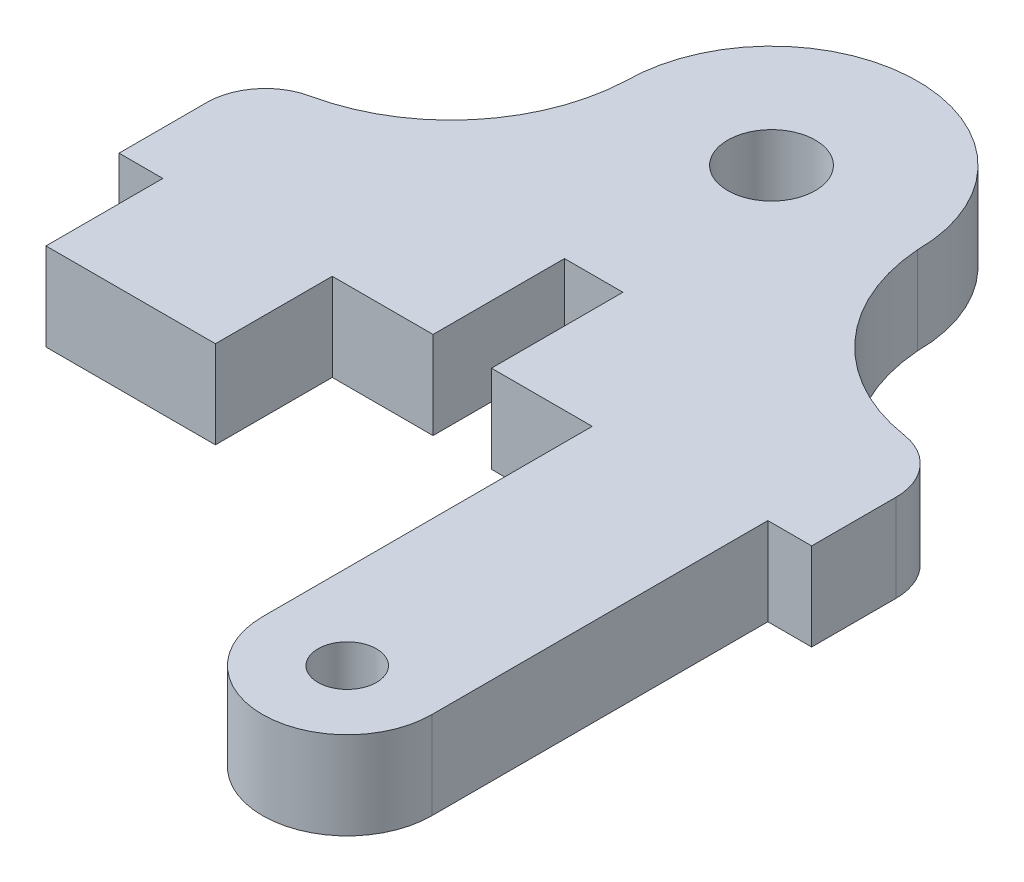
ISO-10303-21;
HEADER;
FILE_DESCRIPTION(('STEP AP214'),'2;1');
FILE_NAME('part.step','',(''),(''),'','','');
FILE_SCHEMA(('AUTOMOTIVE_DESIGN { 1 0 10303 214 1 1 1 1 }'));
ENDSEC;
DATA;
#1=APPLICATION_CONTEXT('core data for automotive mechanical design processes');
#2=APPLICATION_PROTOCOL_DEFINITION('international standard','automotive_design',2000,#1);
#3=PRODUCT_CONTEXT('',#1,'mechanical');
#4=PRODUCT('Part','Part','',(#3));
#5=PRODUCT_RELATED_PRODUCT_CATEGORY('part','',(#4));
#6=PRODUCT_DEFINITION_FORMATION('','',#4);
#7=PRODUCT_DEFINITION_CONTEXT('part definition',#1,'design');
#8=PRODUCT_DEFINITION('design','',#6,#7);
#9=PRODUCT_DEFINITION_SHAPE('','',#8);
#10=(LENGTH_UNIT() NAMED_UNIT(*) SI_UNIT(.MILLI.,.METRE.));
#11=(NAMED_UNIT(*) PLANE_ANGLE_UNIT() SI_UNIT($,.RADIAN.));
#12=(NAMED_UNIT(*) SI_UNIT($,.STERADIAN.) SOLID_ANGLE_UNIT());
#13=UNCERTAINTY_MEASURE_WITH_UNIT(LENGTH_MEASURE(1.E-05),#10,'distance_accuracy_value','');
#14=(GEOMETRIC_REPRESENTATION_CONTEXT(3) GLOBAL_UNCERTAINTY_ASSIGNED_CONTEXT((#13)) GLOBAL_UNIT_ASSIGNED_CONTEXT((#10,
#11,#12)) REPRESENTATION_CONTEXT('',''));
#15=CARTESIAN_POINT('',(0.,0.,0.));
#16=DIRECTION('',(0.,0.,1.));
#17=DIRECTION('',(1.,0.,0.));
#18=AXIS2_PLACEMENT_3D('',#15,#16,#17);
#19=CARTESIAN_POINT('',(7.56861177622339,3.,22.0944304402411));
#20=DIRECTION('',(0.,-1.,0.));
#21=DIRECTION('',(0.,0.,-1.));
#22=AXIS2_PLACEMENT_3D('',#19,#20,#21);
#23=CYLINDRICAL_SURFACE('',#22,2.9);
#24=CARTESIAN_POINT('',(7.56861177622339,0.,22.0944304402411));
#25=DIRECTION('',(0.,1.,0.));
#26=DIRECTION('',(0.,0.,1.));
#27=AXIS2_PLACEMENT_3D('',#24,#25,#26);
#28=CIRCLE('',#27,2.9);
#29=CARTESIAN_POINT('',(4.66861177622339,0.,22.0944304402411));
#30=VERTEX_POINT('',#29);
#31=CARTESIAN_POINT('',(10.4686117762234,0.,22.0944304402411));
#32=VERTEX_POINT('',#31);
#33=EDGE_CURVE('E198',#30,#32,#28,.T.);
#34=ORIENTED_EDGE('',*,*,#33,.T.);
#35=DIRECTION('',(0.,-1.,0.));
#36=VECTOR('',#35,1.);
#37=CARTESIAN_POINT('',(10.4686117762234,3.,22.0944304402411));
#38=LINE('',#37,#36);
#39=CARTESIAN_POINT('',(10.4686117762234,3.,22.0944304402411));
#40=VERTEX_POINT('',#39);
#41=EDGE_CURVE('E179',#40,#32,#38,.T.);
#42=ORIENTED_EDGE('',*,*,#41,.F.);
#43=CARTESIAN_POINT('',(7.56861177622339,3.,22.0944304402411));
#44=DIRECTION('',(0.,1.,0.));
#45=DIRECTION('',(0.,0.,1.));
#46=AXIS2_PLACEMENT_3D('',#43,#44,#45);
#47=CIRCLE('',#46,2.9);
#48=CARTESIAN_POINT('',(4.66861177622339,3.,22.0944304402411));
#49=VERTEX_POINT('',#48);
#50=EDGE_CURVE('E185',#49,#40,#47,.T.);
#51=ORIENTED_EDGE('',*,*,#50,.F.);
#52=DIRECTION('',(0.,-1.,0.));
#53=VECTOR('',#52,1.);
#54=CARTESIAN_POINT('',(4.66861177622339,3.,22.0944304402411));
#55=LINE('',#54,#53);
#56=EDGE_CURVE('E265',#49,#30,#55,.T.);
#57=ORIENTED_EDGE('',*,*,#56,.T.);
#58=EDGE_LOOP('',(#34,#42,#51,#57));
#59=FACE_BOUND('',#58,.T.);
#60=ADVANCED_FACE('F37',(#59),#23,.T.);
#61=CARTESIAN_POINT('',(10.4686117762234,3.,10.5944304402411));
#62=DIRECTION('',(-1.,0.,0.));
#63=DIRECTION('',(0.,0.,1.));
#64=AXIS2_PLACEMENT_3D('',#61,#62,#63);
#65=PLANE('',#64);
#66=DIRECTION('',(0.,0.,-1.));
#67=VECTOR('',#66,1.);
#68=CARTESIAN_POINT('',(10.4686117762234,0.,10.5944304402411));
#69=LINE('',#68,#67);
#70=CARTESIAN_POINT('',(10.4686117762234,0.,10.5944304402411));
#71=VERTEX_POINT('',#70);
#72=EDGE_CURVE('E307',#32,#71,#69,.T.);
#73=ORIENTED_EDGE('',*,*,#72,.T.);
#74=DIRECTION('',(0.,-1.,0.));
#75=VECTOR('',#74,1.);
#76=CARTESIAN_POINT('',(10.4686117762234,3.,10.5944304402411));
#77=LINE('',#76,#75);
#78=CARTESIAN_POINT('',(10.4686117762234,3.,10.5944304402411));
#79=VERTEX_POINT('',#78);
#80=EDGE_CURVE('E182',#79,#71,#77,.T.);
#81=ORIENTED_EDGE('',*,*,#80,.F.);
#82=DIRECTION('',(0.,0.,-1.));
#83=VECTOR('',#82,1.);
#84=CARTESIAN_POINT('',(10.4686117762234,3.,22.0944304402411));
#85=LINE('',#84,#83);
#86=EDGE_CURVE('E175',#40,#79,#85,.T.);
#87=ORIENTED_EDGE('',*,*,#86,.F.);
#88=ORIENTED_EDGE('',*,*,#41,.T.);
#89=EDGE_LOOP('',(#73,#81,#87,#88));
#90=FACE_BOUND('',#89,.T.);
#91=ADVANCED_FACE('F177',(#90),#65,.F.);
#92=CARTESIAN_POINT('',(11.9686117762234,3.,10.5944304402411));
#93=DIRECTION('',(0.,0.,-1.));
#94=DIRECTION('',(-1.,0.,0.));
#95=AXIS2_PLACEMENT_3D('',#92,#93,#94);
#96=PLANE('',#95);
#97=DIRECTION('',(1.,0.,0.));
#98=VECTOR('',#97,1.);
#99=CARTESIAN_POINT('',(11.9686117762234,0.,10.5944304402411));
#100=LINE('',#99,#98);
#101=CARTESIAN_POINT('',(11.9686117762234,0.,10.5944304402411));
#102=VERTEX_POINT('',#101);
#103=EDGE_CURVE('E237',#71,#102,#100,.T.);
#104=ORIENTED_EDGE('',*,*,#103,.T.);
#105=DIRECTION('',(0.,-1.,0.));
#106=VECTOR('',#105,1.);
#107=CARTESIAN_POINT('',(11.9686117762234,3.,10.5944304402411));
#108=LINE('',#107,#106);
#109=CARTESIAN_POINT('',(11.9686117762234,3.,10.5944304402411));
#110=VERTEX_POINT('',#109);
#111=EDGE_CURVE('E204',#110,#102,#108,.T.);
#112=ORIENTED_EDGE('',*,*,#111,.F.);
#113=DIRECTION('',(1.,0.,0.));
#114=VECTOR('',#113,1.);
#115=CARTESIAN_POINT('',(11.9686117762234,3.,10.5944304402411));
#116=LINE('',#115,#114);
#117=EDGE_CURVE('E184',#79,#110,#116,.T.);
#118=ORIENTED_EDGE('',*,*,#117,.F.);
#119=ORIENTED_EDGE('',*,*,#80,.T.);
#120=EDGE_LOOP('',(#104,#112,#118,#119));
#121=FACE_BOUND('',#120,.T.);
#122=ADVANCED_FACE('F367',(#121),#96,.F.);
#123=CARTESIAN_POINT('',(11.9686117762234,3.,5.76185185817519));
#124=DIRECTION('',(-1.,0.,0.));
#125=DIRECTION('',(0.,0.,1.));
#126=AXIS2_PLACEMENT_3D('',#123,#124,#125);
#127=PLANE('',#126);
#128=DIRECTION('',(0.,0.,-1.));
#129=VECTOR('',#128,1.);
#130=CARTESIAN_POINT('',(11.9686117762234,0.,5.76185185817519));
#131=LINE('',#130,#129);
#132=CARTESIAN_POINT('',(11.9686117762234,0.,7.70504570675253));
#133=VERTEX_POINT('',#132);
#134=EDGE_CURVE('E233',#102,#133,#131,.T.);
#135=ORIENTED_EDGE('',*,*,#134,.T.);
#136=DIRECTION('',(0.,-1.,0.));
#137=VECTOR('',#136,1.);
#138=CARTESIAN_POINT('',(11.9686117762234,3.,7.70504570675253));
#139=LINE('',#138,#137);
#140=CARTESIAN_POINT('',(11.9686117762234,3.,7.70504570675253));
#141=VERTEX_POINT('',#140);
#142=EDGE_CURVE('E11',#133,#141,#139,.F.);
#143=ORIENTED_EDGE('',*,*,#142,.T.);
#144=DIRECTION('',(0.,0.,-1.));
#145=VECTOR('',#144,1.);
#146=CARTESIAN_POINT('',(11.9686117762234,3.,5.76185185817519));
#147=LINE('',#146,#145);
#148=EDGE_CURVE('E304',#110,#141,#147,.T.);
#149=ORIENTED_EDGE('',*,*,#148,.F.);
#150=ORIENTED_EDGE('',*,*,#111,.T.);
#151=EDGE_LOOP('',(#135,#143,#149,#150));
#152=FACE_BOUND('',#151,.T.);
#153=ADVANCED_FACE('F303',(#152),#127,.F.);
#154=CARTESIAN_POINT('',(11.2433699404445,3.,-0.455995380189233));
#155=DIRECTION('',(0.,-1.,0.));
#156=DIRECTION('',(0.,0.,-1.));
#157=AXIS2_PLACEMENT_3D('',#154,#155,#156);
#158=CYLINDRICAL_SURFACE('',#157,6.26);
#159=CARTESIAN_POINT('',(11.2433699404445,3.,-0.455995380189233));
#160=DIRECTION('',(0.,-1.,0.));
#161=DIRECTION('',(0.,0.,1.));
#162=AXIS2_PLACEMENT_3D('',#159,#160,#161);
#163=CIRCLE('',#162,6.26);
#164=CARTESIAN_POINT('',(10.2772699273665,3.,5.72900670265041));
#165=VERTEX_POINT('',#164);
#166=CARTESIAN_POINT('',(5.,3.,0.));
#167=VERTEX_POINT('',#166);
#168=EDGE_CURVE('E224',#165,#167,#163,.T.);
#169=ORIENTED_EDGE('',*,*,#168,.F.);
#170=DIRECTION('',(0.,-1.,0.));
#171=VECTOR('',#170,1.);
#172=CARTESIAN_POINT('',(10.2772699273665,3.,5.72900670265041));
#173=LINE('',#172,#171);
#174=CARTESIAN_POINT('',(10.2772699273665,0.,5.72900670265041));
#175=VERTEX_POINT('',#174);
#176=EDGE_CURVE('E46',#165,#175,#173,.T.);
#177=ORIENTED_EDGE('',*,*,#176,.T.);
#178=CARTESIAN_POINT('',(11.2433699404445,0.,-0.455995380189233));
#179=DIRECTION('',(0.,-1.,0.));
#180=DIRECTION('',(0.,0.,1.));
#181=AXIS2_PLACEMENT_3D('',#178,#179,#180);
#182=CIRCLE('',#181,6.26);
#183=CARTESIAN_POINT('',(5.,0.,0.));
#184=VERTEX_POINT('',#183);
#185=EDGE_CURVE('E222',#175,#184,#182,.T.);
#186=ORIENTED_EDGE('',*,*,#185,.T.);
#187=DIRECTION('',(0.,-1.,0.));
#188=VECTOR('',#187,1.);
#189=CARTESIAN_POINT('',(5.,3.,0.));
#190=LINE('',#189,#188);
#191=EDGE_CURVE('E300',#167,#184,#190,.T.);
#192=ORIENTED_EDGE('',*,*,#191,.F.);
#193=EDGE_LOOP('',(#169,#177,#186,#192));
#194=FACE_BOUND('',#193,.T.);
#195=ADVANCED_FACE('F220',(#194),#158,.F.);
#196=CARTESIAN_POINT('',(0.,3.,0.));
#197=DIRECTION('',(0.,-1.,0.));
#198=DIRECTION('',(0.,0.,-1.));
#199=AXIS2_PLACEMENT_3D('',#196,#197,#198);
#200=CYLINDRICAL_SURFACE('',#199,5.);
#201=CARTESIAN_POINT('',(0.,0.,0.));
#202=DIRECTION('',(0.,1.,0.));
#203=DIRECTION('',(0.,0.,1.));
#204=AXIS2_PLACEMENT_3D('',#201,#202,#203);
#205=CIRCLE('',#204,5.);
#206=CARTESIAN_POINT('',(-5.,0.,0.));
#207=VERTEX_POINT('',#206);
#208=EDGE_CURVE('E232',#184,#207,#205,.T.);
#209=ORIENTED_EDGE('',*,*,#208,.T.);
#210=DIRECTION('',(0.,-1.,0.));
#211=VECTOR('',#210,1.);
#212=CARTESIAN_POINT('',(-5.,3.,0.));
#213=LINE('',#212,#211);
#214=CARTESIAN_POINT('',(-5.,3.,0.));
#215=VERTEX_POINT('',#214);
#216=EDGE_CURVE('E297',#215,#207,#213,.T.);
#217=ORIENTED_EDGE('',*,*,#216,.F.);
#218=CARTESIAN_POINT('',(0.,3.,0.));
#219=DIRECTION('',(0.,1.,0.));
#220=DIRECTION('',(0.,0.,1.));
#221=AXIS2_PLACEMENT_3D('',#218,#219,#220);
#222=CIRCLE('',#221,5.);
#223=EDGE_CURVE('E335',#167,#215,#222,.T.);
#224=ORIENTED_EDGE('',*,*,#223,.F.);
#225=ORIENTED_EDGE('',*,*,#191,.T.);
#226=EDGE_LOOP('',(#209,#217,#224,#225));
#227=FACE_BOUND('',#226,.T.);
#228=ADVANCED_FACE('F437',(#227),#200,.T.);
#229=CARTESIAN_POINT('',(-11.2526114962713,3.,-0.278776727505315));
#230=DIRECTION('',(0.,-1.,0.));
#231=DIRECTION('',(0.,0.,-1.));
#232=AXIS2_PLACEMENT_3D('',#229,#230,#231);
#233=CYLINDRICAL_SURFACE('',#232,6.25882313115674);
#234=CARTESIAN_POINT('',(-11.2526114962713,0.,-0.278776727505315));
#235=DIRECTION('',(0.,-1.,0.));
#236=DIRECTION('',(0.,0.,1.));
#237=AXIS2_PLACEMENT_3D('',#234,#235,#236);
#238=CIRCLE('',#237,6.25882313115674);
#239=CARTESIAN_POINT('',(-9.94820869448056,0.,5.84261202977707));
#240=VERTEX_POINT('',#239);
#241=EDGE_CURVE('E235',#207,#240,#238,.T.);
#242=ORIENTED_EDGE('',*,*,#241,.T.);
#243=DIRECTION('',(0.,-1.,0.));
#244=VECTOR('',#243,1.);
#245=CARTESIAN_POINT('',(-9.94820869448056,3.,5.84261202977707));
#246=LINE('',#245,#244);
#247=CARTESIAN_POINT('',(-9.94820869448056,3.,5.84261202977707));
#248=VERTEX_POINT('',#247);
#249=EDGE_CURVE('E211',#240,#248,#246,.F.);
#250=ORIENTED_EDGE('',*,*,#249,.T.);
#251=CARTESIAN_POINT('',(-11.2526114962713,3.,-0.278776727505315));
#252=DIRECTION('',(0.,-1.,0.));
#253=DIRECTION('',(0.,0.,1.));
#254=AXIS2_PLACEMENT_3D('',#251,#252,#253);
#255=CIRCLE('',#254,6.25882313115674);
#256=EDGE_CURVE('E333',#215,#248,#255,.T.);
#257=ORIENTED_EDGE('',*,*,#256,.F.);
#258=ORIENTED_EDGE('',*,*,#216,.T.);
#259=EDGE_LOOP('',(#242,#250,#257,#258));
#260=FACE_BOUND('',#259,.T.);
#261=ADVANCED_FACE('F433',(#260),#233,.F.);
#262=CARTESIAN_POINT('',(-11.5313882237766,3.,10.8064133508319));
#263=DIRECTION('',(1.,0.,0.));
#264=DIRECTION('',(0.,0.,-1.));
#265=AXIS2_PLACEMENT_3D('',#262,#263,#264);
#266=PLANE('',#265);
#267=DIRECTION('',(0.,0.,1.));
#268=VECTOR('',#267,1.);
#269=CARTESIAN_POINT('',(-11.5313882237766,3.,10.8064133508319));
#270=LINE('',#269,#268);
#271=CARTESIAN_POINT('',(-11.5313882237766,3.,7.79869502781221));
#272=VERTEX_POINT('',#271);
#273=CARTESIAN_POINT('',(-11.5313882237766,3.,10.8064133508319));
#274=VERTEX_POINT('',#273);
#275=EDGE_CURVE('E331',#272,#274,#270,.T.);
#276=ORIENTED_EDGE('',*,*,#275,.F.);
#277=DIRECTION('',(0.,-1.,0.));
#278=VECTOR('',#277,1.);
#279=CARTESIAN_POINT('',(-11.5313882237766,3.,7.79869502781221));
#280=LINE('',#279,#278);
#281=CARTESIAN_POINT('',(-11.5313882237766,0.,7.79869502781221));
#282=VERTEX_POINT('',#281);
#283=EDGE_CURVE('E199',#272,#282,#280,.T.);
#284=ORIENTED_EDGE('',*,*,#283,.T.);
#285=DIRECTION('',(0.,0.,1.));
#286=VECTOR('',#285,1.);
#287=CARTESIAN_POINT('',(-11.5313882237766,0.,10.8064133508319));
#288=LINE('',#287,#286);
#289=CARTESIAN_POINT('',(-11.5313882237766,0.,10.8064133508319));
#290=VERTEX_POINT('',#289);
#291=EDGE_CURVE('E243',#282,#290,#288,.T.);
#292=ORIENTED_EDGE('',*,*,#291,.T.);
#293=DIRECTION('',(0.,-1.,0.));
#294=VECTOR('',#293,1.);
#295=CARTESIAN_POINT('',(-11.5313882237766,3.,10.8064133508319));
#296=LINE('',#295,#294);
#297=EDGE_CURVE('E294',#274,#290,#296,.T.);
#298=ORIENTED_EDGE('',*,*,#297,.F.);
#299=EDGE_LOOP('',(#276,#284,#292,#298));
#300=FACE_BOUND('',#299,.T.);
#301=ADVANCED_FACE('F384',(#300),#266,.F.);
#302=CARTESIAN_POINT('',(-11.5313882237766,3.,10.8064133508319));
#303=DIRECTION('',(0.,0.,-1.));
#304=DIRECTION('',(-1.,0.,0.));
#305=AXIS2_PLACEMENT_3D('',#302,#303,#304);
#306=PLANE('',#305);
#307=DIRECTION('',(1.,0.,0.));
#308=VECTOR('',#307,1.);
#309=CARTESIAN_POINT('',(-11.5313882237766,0.,10.8064133508319));
#310=LINE('',#309,#308);
#311=CARTESIAN_POINT('',(-10.0313882237766,0.,10.8064133508319));
#312=VERTEX_POINT('',#311);
#313=EDGE_CURVE('E245',#290,#312,#310,.T.);
#314=ORIENTED_EDGE('',*,*,#313,.T.);
#315=DIRECTION('',(0.,-1.,0.));
#316=VECTOR('',#315,1.);
#317=CARTESIAN_POINT('',(-10.0313882237766,3.,10.8064133508319));
#318=LINE('',#317,#316);
#319=CARTESIAN_POINT('',(-10.0313882237766,3.,10.8064133508319));
#320=VERTEX_POINT('',#319);
#321=EDGE_CURVE('E291',#320,#312,#318,.T.);
#322=ORIENTED_EDGE('',*,*,#321,.F.);
#323=DIRECTION('',(1.,0.,0.));
#324=VECTOR('',#323,1.);
#325=CARTESIAN_POINT('',(-11.5313882237766,3.,10.8064133508319));
#326=LINE('',#325,#324);
#327=EDGE_CURVE('E329',#274,#320,#326,.T.);
#328=ORIENTED_EDGE('',*,*,#327,.F.);
#329=ORIENTED_EDGE('',*,*,#297,.T.);
#330=EDGE_LOOP('',(#314,#322,#328,#329));
#331=FACE_BOUND('',#330,.T.);
#332=ADVANCED_FACE('F389',(#331),#306,.F.);
#333=CARTESIAN_POINT('',(-10.0313882237766,3.,10.8064133508319));
#334=DIRECTION('',(1.,0.,0.));
#335=DIRECTION('',(0.,0.,-1.));
#336=AXIS2_PLACEMENT_3D('',#333,#334,#335);
#337=PLANE('',#336);
#338=DIRECTION('',(0.,0.,1.));
#339=VECTOR('',#338,1.);
#340=CARTESIAN_POINT('',(-10.0313882237766,0.,10.8064133508319));
#341=LINE('',#340,#339);
#342=CARTESIAN_POINT('',(-10.0313882237766,0.,14.8064133508319));
#343=VERTEX_POINT('',#342);
#344=EDGE_CURVE('E247',#312,#343,#341,.T.);
#345=ORIENTED_EDGE('',*,*,#344,.T.);
#346=DIRECTION('',(0.,-1.,0.));
#347=VECTOR('',#346,1.);
#348=CARTESIAN_POINT('',(-10.0313882237766,3.,14.8064133508319));
#349=LINE('',#348,#347);
#350=CARTESIAN_POINT('',(-10.0313882237766,3.,14.8064133508319));
#351=VERTEX_POINT('',#350);
#352=EDGE_CURVE('E288',#351,#343,#349,.T.);
#353=ORIENTED_EDGE('',*,*,#352,.F.);
#354=DIRECTION('',(0.,0.,1.));
#355=VECTOR('',#354,1.);
#356=CARTESIAN_POINT('',(-10.0313882237766,3.,10.8064133508319));
#357=LINE('',#356,#355);
#358=EDGE_CURVE('E327',#320,#351,#357,.T.);
#359=ORIENTED_EDGE('',*,*,#358,.F.);
#360=ORIENTED_EDGE('',*,*,#321,.T.);
#361=EDGE_LOOP('',(#345,#353,#359,#360));
#362=FACE_BOUND('',#361,.T.);
#363=ADVANCED_FACE('F395',(#362),#337,.F.);
#364=CARTESIAN_POINT('',(-10.0313882237766,3.,14.8064133508319));
#365=DIRECTION('',(0.,0.,-1.));
#366=DIRECTION('',(-1.,0.,0.));
#367=AXIS2_PLACEMENT_3D('',#364,#365,#366);
#368=PLANE('',#367);
#369=DIRECTION('',(1.,0.,0.));
#370=VECTOR('',#369,1.);
#371=CARTESIAN_POINT('',(-10.0313882237766,0.,14.8064133508319));
#372=LINE('',#371,#370);
#373=CARTESIAN_POINT('',(-4.23138822377662,0.,14.8064133508319));
#374=VERTEX_POINT('',#373);
#375=EDGE_CURVE('E249',#343,#374,#372,.T.);
#376=ORIENTED_EDGE('',*,*,#375,.T.);
#377=DIRECTION('',(0.,-1.,0.));
#378=VECTOR('',#377,1.);
#379=CARTESIAN_POINT('',(-4.23138822377662,3.,14.8064133508319));
#380=LINE('',#379,#378);
#381=CARTESIAN_POINT('',(-4.23138822377662,3.,14.8064133508319));
#382=VERTEX_POINT('',#381);
#383=EDGE_CURVE('E285',#382,#374,#380,.T.);
#384=ORIENTED_EDGE('',*,*,#383,.F.);
#385=DIRECTION('',(1.,0.,0.));
#386=VECTOR('',#385,1.);
#387=CARTESIAN_POINT('',(-10.0313882237766,3.,14.8064133508319));
#388=LINE('',#387,#386);
#389=EDGE_CURVE('E325',#351,#382,#388,.T.);
#390=ORIENTED_EDGE('',*,*,#389,.F.);
#391=ORIENTED_EDGE('',*,*,#352,.T.);
#392=EDGE_LOOP('',(#376,#384,#390,#391));
#393=FACE_BOUND('',#392,.T.);
#394=ADVANCED_FACE('F399',(#393),#368,.F.);
#395=CARTESIAN_POINT('',(-4.23138822377662,3.,14.8064133508319));
#396=DIRECTION('',(-1.,0.,0.));
#397=DIRECTION('',(0.,0.,1.));
#398=AXIS2_PLACEMENT_3D('',#395,#396,#397);
#399=PLANE('',#398);
#400=DIRECTION('',(0.,0.,-1.));
#401=VECTOR('',#400,1.);
#402=CARTESIAN_POINT('',(-4.23138822377662,0.,14.8064133508319));
#403=LINE('',#402,#401);
#404=CARTESIAN_POINT('',(-4.23138822377662,0.,10.8064133508319));
#405=VERTEX_POINT('',#404);
#406=EDGE_CURVE('E251',#374,#405,#403,.T.);
#407=ORIENTED_EDGE('',*,*,#406,.T.);
#408=DIRECTION('',(0.,-1.,0.));
#409=VECTOR('',#408,1.);
#410=CARTESIAN_POINT('',(-4.23138822377662,3.,10.8064133508319));
#411=LINE('',#410,#409);
#412=CARTESIAN_POINT('',(-4.23138822377662,3.,10.8064133508319));
#413=VERTEX_POINT('',#412);
#414=EDGE_CURVE('E282',#413,#405,#411,.T.);
#415=ORIENTED_EDGE('',*,*,#414,.F.);
#416=DIRECTION('',(0.,0.,-1.));
#417=VECTOR('',#416,1.);
#418=CARTESIAN_POINT('',(-4.23138822377662,3.,14.8064133508319));
#419=LINE('',#418,#417);
#420=EDGE_CURVE('E323',#382,#413,#419,.T.);
#421=ORIENTED_EDGE('',*,*,#420,.F.);
#422=ORIENTED_EDGE('',*,*,#383,.T.);
#423=EDGE_LOOP('',(#407,#415,#421,#422));
#424=FACE_BOUND('',#423,.T.);
#425=ADVANCED_FACE('F404',(#424),#399,.F.);
#426=CARTESIAN_POINT('',(-4.23138822377662,3.,10.8064133508319));
#427=DIRECTION('',(0.,0.,-1.));
#428=DIRECTION('',(-1.,0.,0.));
#429=AXIS2_PLACEMENT_3D('',#426,#427,#428);
#430=PLANE('',#429);
#431=DIRECTION('',(1.,0.,0.));
#432=VECTOR('',#431,1.);
#433=CARTESIAN_POINT('',(-4.23138822377662,0.,10.8064133508319));
#434=LINE('',#433,#432);
#435=CARTESIAN_POINT('',(-0.781388223776621,0.,10.8064133508319));
#436=VERTEX_POINT('',#435);
#437=EDGE_CURVE('E253',#405,#436,#434,.T.);
#438=ORIENTED_EDGE('',*,*,#437,.T.);
#439=DIRECTION('',(0.,-1.,0.));
#440=VECTOR('',#439,1.);
#441=CARTESIAN_POINT('',(-0.781388223776621,3.,10.8064133508319));
#442=LINE('',#441,#440);
#443=CARTESIAN_POINT('',(-0.781388223776621,3.,10.8064133508319));
#444=VERTEX_POINT('',#443);
#445=EDGE_CURVE('E279',#444,#436,#442,.T.);
#446=ORIENTED_EDGE('',*,*,#445,.F.);
#447=DIRECTION('',(1.,0.,0.));
#448=VECTOR('',#447,1.);
#449=CARTESIAN_POINT('',(-4.23138822377662,3.,10.8064133508319));
#450=LINE('',#449,#448);
#451=EDGE_CURVE('E321',#413,#444,#450,.T.);
#452=ORIENTED_EDGE('',*,*,#451,.F.);
#453=ORIENTED_EDGE('',*,*,#414,.T.);
#454=EDGE_LOOP('',(#438,#446,#452,#453));
#455=FACE_BOUND('',#454,.T.);
#456=ADVANCED_FACE('F410',(#455),#430,.F.);
#457=CARTESIAN_POINT('',(-0.781388223776621,3.,10.8064133508319));
#458=DIRECTION('',(-1.,0.,0.));
#459=DIRECTION('',(0.,0.,1.));
#460=AXIS2_PLACEMENT_3D('',#457,#458,#459);
#461=PLANE('',#460);
#462=DIRECTION('',(0.,0.,-1.));
#463=VECTOR('',#462,1.);
#464=CARTESIAN_POINT('',(-0.781388223776621,0.,10.8064133508319));
#465=LINE('',#464,#463);
#466=CARTESIAN_POINT('',(-0.781388223776621,0.,6.30641335083188));
#467=VERTEX_POINT('',#466);
#468=EDGE_CURVE('E255',#436,#467,#465,.T.);
#469=ORIENTED_EDGE('',*,*,#468,.T.);
#470=DIRECTION('',(0.,-1.,0.));
#471=VECTOR('',#470,1.);
#472=CARTESIAN_POINT('',(-0.781388223776621,3.,6.30641335083188));
#473=LINE('',#472,#471);
#474=CARTESIAN_POINT('',(-0.781388223776621,3.,6.30641335083188));
#475=VERTEX_POINT('',#474);
#476=EDGE_CURVE('E276',#475,#467,#473,.T.);
#477=ORIENTED_EDGE('',*,*,#476,.F.);
#478=DIRECTION('',(0.,0.,-1.));
#479=VECTOR('',#478,1.);
#480=CARTESIAN_POINT('',(-0.781388223776621,3.,10.8064133508319));
#481=LINE('',#480,#479);
#482=EDGE_CURVE('E319',#444,#475,#481,.T.);
#483=ORIENTED_EDGE('',*,*,#482,.F.);
#484=ORIENTED_EDGE('',*,*,#445,.T.);
#485=EDGE_LOOP('',(#469,#477,#483,#484));
#486=FACE_BOUND('',#485,.T.);
#487=ADVANCED_FACE('F414',(#486),#461,.F.);
#488=CARTESIAN_POINT('',(-0.781388223776621,3.,6.30641335083188));
#489=DIRECTION('',(0.,0.,-1.));
#490=DIRECTION('',(-1.,0.,0.));
#491=AXIS2_PLACEMENT_3D('',#488,#489,#490);
#492=PLANE('',#491);
#493=DIRECTION('',(1.,0.,0.));
#494=VECTOR('',#493,1.);
#495=CARTESIAN_POINT('',(-0.781388223776621,0.,6.30641335083188));
#496=LINE('',#495,#494);
#497=CARTESIAN_POINT('',(1.21861177622338,0.,6.30641335083188));
#498=VERTEX_POINT('',#497);
#499=EDGE_CURVE('E257',#467,#498,#496,.T.);
#500=ORIENTED_EDGE('',*,*,#499,.T.);
#501=DIRECTION('',(0.,-1.,0.));
#502=VECTOR('',#501,1.);
#503=CARTESIAN_POINT('',(1.21861177622338,3.,6.30641335083188));
#504=LINE('',#503,#502);
#505=CARTESIAN_POINT('',(1.21861177622338,3.,6.30641335083188));
#506=VERTEX_POINT('',#505);
#507=EDGE_CURVE('E273',#506,#498,#504,.T.);
#508=ORIENTED_EDGE('',*,*,#507,.F.);
#509=DIRECTION('',(1.,0.,0.));
#510=VECTOR('',#509,1.);
#511=CARTESIAN_POINT('',(-0.781388223776621,3.,6.30641335083188));
#512=LINE('',#511,#510);
#513=EDGE_CURVE('E317',#475,#506,#512,.T.);
#514=ORIENTED_EDGE('',*,*,#513,.F.);
#515=ORIENTED_EDGE('',*,*,#476,.T.);
#516=EDGE_LOOP('',(#500,#508,#514,#515));
#517=FACE_BOUND('',#516,.T.);
#518=ADVANCED_FACE('F419',(#517),#492,.F.);
#519=CARTESIAN_POINT('',(1.21861177622338,3.,6.30641335083188));
#520=DIRECTION('',(1.,0.,0.));
#521=DIRECTION('',(0.,0.,-1.));
#522=AXIS2_PLACEMENT_3D('',#519,#520,#521);
#523=PLANE('',#522);
#524=DIRECTION('',(0.,0.,1.));
#525=VECTOR('',#524,1.);
#526=CARTESIAN_POINT('',(1.21861177622338,0.,6.30641335083188));
#527=LINE('',#526,#525);
#528=CARTESIAN_POINT('',(1.21861177622338,0.,10.8064133508319));
#529=VERTEX_POINT('',#528);
#530=EDGE_CURVE('E259',#498,#529,#527,.T.);
#531=ORIENTED_EDGE('',*,*,#530,.T.);
#532=DIRECTION('',(0.,-1.,0.));
#533=VECTOR('',#532,1.);
#534=CARTESIAN_POINT('',(1.21861177622338,3.,10.8064133508319));
#535=LINE('',#534,#533);
#536=CARTESIAN_POINT('',(1.21861177622338,3.,10.8064133508319));
#537=VERTEX_POINT('',#536);
#538=EDGE_CURVE('E270',#537,#529,#535,.T.);
#539=ORIENTED_EDGE('',*,*,#538,.F.);
#540=DIRECTION('',(0.,0.,1.));
#541=VECTOR('',#540,1.);
#542=CARTESIAN_POINT('',(1.21861177622338,3.,6.30641335083188));
#543=LINE('',#542,#541);
#544=EDGE_CURVE('E315',#506,#537,#543,.T.);
#545=ORIENTED_EDGE('',*,*,#544,.F.);
#546=ORIENTED_EDGE('',*,*,#507,.T.);
#547=EDGE_LOOP('',(#531,#539,#545,#546));
#548=FACE_BOUND('',#547,.T.);
#549=ADVANCED_FACE('F425',(#548),#523,.F.);
#550=CARTESIAN_POINT('',(1.21861177622338,3.,10.8064133508319));
#551=DIRECTION('',(0.,0.,-1.));
#552=DIRECTION('',(-1.,0.,0.));
#553=AXIS2_PLACEMENT_3D('',#550,#551,#552);
#554=PLANE('',#553);
#555=DIRECTION('',(1.,0.,0.));
#556=VECTOR('',#555,1.);
#557=CARTESIAN_POINT('',(1.21861177622338,0.,10.8064133508319));
#558=LINE('',#557,#556);
#559=CARTESIAN_POINT('',(4.66861177622338,0.,10.8064133508319));
#560=VERTEX_POINT('',#559);
#561=EDGE_CURVE('E261',#529,#560,#558,.T.);
#562=ORIENTED_EDGE('',*,*,#561,.T.);
#563=DIRECTION('',(0.,-1.,0.));
#564=VECTOR('',#563,1.);
#565=CARTESIAN_POINT('',(4.66861177622338,3.,10.8064133508319));
#566=LINE('',#565,#564);
#567=CARTESIAN_POINT('',(4.66861177622338,3.,10.8064133508319));
#568=VERTEX_POINT('',#567);
#569=EDGE_CURVE('E267',#568,#560,#566,.T.);
#570=ORIENTED_EDGE('',*,*,#569,.F.);
#571=DIRECTION('',(1.,0.,0.));
#572=VECTOR('',#571,1.);
#573=CARTESIAN_POINT('',(1.21861177622338,3.,10.8064133508319));
#574=LINE('',#573,#572);
#575=EDGE_CURVE('E313',#537,#568,#574,.T.);
#576=ORIENTED_EDGE('',*,*,#575,.F.);
#577=ORIENTED_EDGE('',*,*,#538,.T.);
#578=EDGE_LOOP('',(#562,#570,#576,#577));
#579=FACE_BOUND('',#578,.T.);
#580=ADVANCED_FACE('F429',(#579),#554,.F.);
#581=CARTESIAN_POINT('',(4.66861177622338,3.,14.5944304402411));
#582=DIRECTION('',(1.,0.,0.));
#583=DIRECTION('',(0.,0.,-1.));
#584=AXIS2_PLACEMENT_3D('',#581,#582,#583);
#585=PLANE('',#584);
#586=DIRECTION('',(0.,0.,1.));
#587=VECTOR('',#586,1.);
#588=CARTESIAN_POINT('',(4.66861177622338,0.,14.5944304402411));
#589=LINE('',#588,#587);
#590=EDGE_CURVE('E195',#560,#30,#589,.T.);
#591=ORIENTED_EDGE('',*,*,#590,.T.);
#592=ORIENTED_EDGE('',*,*,#56,.F.);
#593=DIRECTION('',(0.,0.,1.));
#594=VECTOR('',#593,1.);
#595=CARTESIAN_POINT('',(4.66861177622338,3.,14.5944304402411));
#596=LINE('',#595,#594);
#597=EDGE_CURVE('E191',#568,#49,#596,.T.);
#598=ORIENTED_EDGE('',*,*,#597,.F.);
#599=ORIENTED_EDGE('',*,*,#569,.T.);
#600=EDGE_LOOP('',(#591,#592,#598,#599));
#601=FACE_BOUND('',#600,.T.);
#602=ADVANCED_FACE('F431',(#601),#585,.F.);
#603=CARTESIAN_POINT('',(7.56861177622339,3.,22.0944304402411));
#604=DIRECTION('',(0.,1.,0.));
#605=DIRECTION('',(0.,0.,1.));
#606=AXIS2_PLACEMENT_3D('',#603,#604,#605);
#607=PLANE('',#606);
#608=CARTESIAN_POINT('',(7.56861177622339,3.,22.0944304402411));
#609=DIRECTION('',(0.,1.,0.));
#610=DIRECTION('',(0.,0.,1.));
#611=AXIS2_PLACEMENT_3D('',#608,#609,#610);
#612=CIRCLE('',#611,1.);
#613=CARTESIAN_POINT('',(7.56861177622339,3.,23.0944304402411));
#614=VERTEX_POINT('',#613);
#615=EDGE_CURVE('E345',#614,#614,#612,.T.);
#616=ORIENTED_EDGE('',*,*,#615,.F.);
#617=EDGE_LOOP('',(#616));
#618=FACE_BOUND('',#617,.T.);
#619=CARTESIAN_POINT('',(0.,3.,0.));
#620=DIRECTION('',(0.,1.,0.));
#621=DIRECTION('',(0.,0.,1.));
#622=AXIS2_PLACEMENT_3D('',#619,#620,#621);
#623=CIRCLE('',#622,1.5);
#624=CARTESIAN_POINT('',(0.,3.,1.5));
#625=VERTEX_POINT('',#624);
#626=EDGE_CURVE('E340',#625,#625,#623,.T.);
#627=ORIENTED_EDGE('',*,*,#626,.F.);
#628=EDGE_LOOP('',(#627));
#629=FACE_BOUND('',#628,.T.);
#630=ORIENTED_EDGE('',*,*,#256,.T.);
#631=CARTESIAN_POINT('',(-9.53138822377661,3.,7.79869502781221));
#632=DIRECTION('',(0.,1.,0.));
#633=DIRECTION('',(0.,0.,1.));
#634=AXIS2_PLACEMENT_3D('',#631,#632,#633);
#635=CIRCLE('',#634,2.);
#636=EDGE_CURVE('E214',#248,#272,#635,.T.);
#637=ORIENTED_EDGE('',*,*,#636,.T.);
#638=ORIENTED_EDGE('',*,*,#275,.T.);
#639=ORIENTED_EDGE('',*,*,#327,.T.);
#640=ORIENTED_EDGE('',*,*,#358,.T.);
#641=ORIENTED_EDGE('',*,*,#389,.T.);
#642=ORIENTED_EDGE('',*,*,#420,.T.);
#643=ORIENTED_EDGE('',*,*,#451,.T.);
#644=ORIENTED_EDGE('',*,*,#482,.T.);
#645=ORIENTED_EDGE('',*,*,#513,.T.);
#646=ORIENTED_EDGE('',*,*,#544,.T.);
#647=ORIENTED_EDGE('',*,*,#575,.T.);
#648=ORIENTED_EDGE('',*,*,#597,.T.);
#649=ORIENTED_EDGE('',*,*,#50,.T.);
#650=ORIENTED_EDGE('',*,*,#86,.T.);
#651=ORIENTED_EDGE('',*,*,#117,.T.);
#652=ORIENTED_EDGE('',*,*,#148,.T.);
#653=CARTESIAN_POINT('',(9.96861177622339,3.,7.70504570675253));
#654=DIRECTION('',(0.,1.,0.));
#655=DIRECTION('',(0.,0.,1.));
#656=AXIS2_PLACEMENT_3D('',#653,#654,#655);
#657=CIRCLE('',#656,2.);
#658=EDGE_CURVE('E53',#141,#165,#657,.T.);
#659=ORIENTED_EDGE('',*,*,#658,.T.);
#660=ORIENTED_EDGE('',*,*,#168,.T.);
#661=ORIENTED_EDGE('',*,*,#223,.T.);
#662=EDGE_LOOP('',(#630,#637,#638,#639,#640,#641,#642,#643,#644,#645,#646,#647,#648,#649,#650,
#651,#652,#659,#660,#661));
#663=FACE_BOUND('',#662,.T.);
#664=ADVANCED_FACE('F189',(#618,#629,#663),#607,.T.);
#665=CARTESIAN_POINT('',(7.56861177622339,0.,22.0944304402411));
#666=DIRECTION('',(0.,1.,0.));
#667=DIRECTION('',(0.,0.,1.));
#668=AXIS2_PLACEMENT_3D('',#665,#666,#667);
#669=PLANE('',#668);
#670=CARTESIAN_POINT('',(7.56861177622339,0.,22.0944304402411));
#671=DIRECTION('',(0.,1.,0.));
#672=DIRECTION('',(0.,0.,1.));
#673=AXIS2_PLACEMENT_3D('',#670,#671,#672);
#674=CIRCLE('',#673,1.);
#675=CARTESIAN_POINT('',(7.56861177622339,0.,23.0944304402411));
#676=VERTEX_POINT('',#675);
#677=EDGE_CURVE('E41',#676,#676,#674,.T.);
#678=ORIENTED_EDGE('',*,*,#677,.T.);
#679=EDGE_LOOP('',(#678));
#680=FACE_BOUND('',#679,.T.);
#681=CARTESIAN_POINT('',(0.,0.,0.));
#682=DIRECTION('',(0.,1.,0.));
#683=DIRECTION('',(0.,0.,1.));
#684=AXIS2_PLACEMENT_3D('',#681,#682,#683);
#685=CIRCLE('',#684,1.5);
#686=CARTESIAN_POINT('',(0.,0.,1.5));
#687=VERTEX_POINT('',#686);
#688=EDGE_CURVE('E311',#687,#687,#685,.T.);
#689=ORIENTED_EDGE('',*,*,#688,.T.);
#690=EDGE_LOOP('',(#689));
#691=FACE_BOUND('',#690,.T.);
#692=ORIENTED_EDGE('',*,*,#291,.F.);
#693=CARTESIAN_POINT('',(-9.53138822377661,0.,7.79869502781221));
#694=DIRECTION('',(0.,1.,0.));
#695=DIRECTION('',(0.,0.,1.));
#696=AXIS2_PLACEMENT_3D('',#693,#694,#695);
#697=CIRCLE('',#696,2.);
#698=EDGE_CURVE('E209',#282,#240,#697,.F.);
#699=ORIENTED_EDGE('',*,*,#698,.T.);
#700=ORIENTED_EDGE('',*,*,#241,.F.);
#701=ORIENTED_EDGE('',*,*,#208,.F.);
#702=ORIENTED_EDGE('',*,*,#185,.F.);
#703=CARTESIAN_POINT('',(9.96861177622339,0.,7.70504570675253));
#704=DIRECTION('',(0.,1.,0.));
#705=DIRECTION('',(0.,0.,1.));
#706=AXIS2_PLACEMENT_3D('',#703,#704,#705);
#707=CIRCLE('',#706,2.);
#708=EDGE_CURVE('E202',#175,#133,#707,.F.);
#709=ORIENTED_EDGE('',*,*,#708,.T.);
#710=ORIENTED_EDGE('',*,*,#134,.F.);
#711=ORIENTED_EDGE('',*,*,#103,.F.);
#712=ORIENTED_EDGE('',*,*,#72,.F.);
#713=ORIENTED_EDGE('',*,*,#33,.F.);
#714=ORIENTED_EDGE('',*,*,#590,.F.);
#715=ORIENTED_EDGE('',*,*,#561,.F.);
#716=ORIENTED_EDGE('',*,*,#530,.F.);
#717=ORIENTED_EDGE('',*,*,#499,.F.);
#718=ORIENTED_EDGE('',*,*,#468,.F.);
#719=ORIENTED_EDGE('',*,*,#437,.F.);
#720=ORIENTED_EDGE('',*,*,#406,.F.);
#721=ORIENTED_EDGE('',*,*,#375,.F.);
#722=ORIENTED_EDGE('',*,*,#344,.F.);
#723=ORIENTED_EDGE('',*,*,#313,.F.);
#724=EDGE_LOOP('',(#692,#699,#700,#701,#702,#709,#710,#711,#712,#713,#714,#715,#716,#717,#718,
#719,#720,#721,#722,#723));
#725=FACE_BOUND('',#724,.T.);
#726=ADVANCED_FACE('F229',(#680,#691,#725),#669,.F.);
#727=CARTESIAN_POINT('',(0.,0.,0.));
#728=DIRECTION('',(0.,1.,0.));
#729=DIRECTION('',(0.,0.,1.));
#730=AXIS2_PLACEMENT_3D('',#727,#728,#729);
#731=CYLINDRICAL_SURFACE('',#730,1.5);
#732=ORIENTED_EDGE('',*,*,#688,.F.);
#733=EDGE_LOOP('',(#732));
#734=FACE_BOUND('',#733,.T.);
#735=ORIENTED_EDGE('',*,*,#626,.T.);
#736=EDGE_LOOP('',(#735));
#737=FACE_BOUND('',#736,.T.);
#738=ADVANCED_FACE('F371',(#734,#737),#731,.F.);
#739=CARTESIAN_POINT('',(-9.53138822377661,3.,7.79869502781221));
#740=DIRECTION('',(0.,-1.,0.));
#741=DIRECTION('',(0.,0.,-1.));
#742=AXIS2_PLACEMENT_3D('',#739,#740,#741);
#743=CYLINDRICAL_SURFACE('',#742,2.);
#744=ORIENTED_EDGE('',*,*,#636,.F.);
#745=ORIENTED_EDGE('',*,*,#249,.F.);
#746=ORIENTED_EDGE('',*,*,#698,.F.);
#747=ORIENTED_EDGE('',*,*,#283,.F.);
#748=EDGE_LOOP('',(#744,#745,#746,#747));
#749=FACE_BOUND('',#748,.T.);
#750=ADVANCED_FACE('F360',(#749),#743,.T.);
#751=CARTESIAN_POINT('',(9.96861177622339,3.,7.70504570675253));
#752=DIRECTION('',(0.,-1.,0.));
#753=DIRECTION('',(0.,0.,-1.));
#754=AXIS2_PLACEMENT_3D('',#751,#752,#753);
#755=CYLINDRICAL_SURFACE('',#754,2.);
#756=ORIENTED_EDGE('',*,*,#658,.F.);
#757=ORIENTED_EDGE('',*,*,#142,.F.);
#758=ORIENTED_EDGE('',*,*,#708,.F.);
#759=ORIENTED_EDGE('',*,*,#176,.F.);
#760=EDGE_LOOP('',(#756,#757,#758,#759));
#761=FACE_BOUND('',#760,.T.);
#762=ADVANCED_FACE('F39',(#761),#755,.T.);
#763=CARTESIAN_POINT('',(7.56861177622339,-7.,22.0944304402411));
#764=DIRECTION('',(0.,1.,0.));
#765=DIRECTION('',(0.,0.,1.));
#766=AXIS2_PLACEMENT_3D('',#763,#764,#765);
#767=CYLINDRICAL_SURFACE('',#766,1.);
#768=ORIENTED_EDGE('',*,*,#615,.T.);
#769=EDGE_LOOP('',(#768));
#770=FACE_BOUND('',#769,.T.);
#771=ORIENTED_EDGE('',*,*,#677,.F.);
#772=EDGE_LOOP('',(#771));
#773=FACE_BOUND('',#772,.T.);
#774=ADVANCED_FACE('F354',(#770,#773),#767,.F.);
#775=CLOSED_SHELL('',(#60,#91,#122,#153,#195,#228,#261,#301,#332,#363,#394,#425,#456,#487,#518,
#549,#580,#602,#664,#726,#738,#750,#762,#774));
#776=MANIFOLD_SOLID_BREP('B2',#775);
#777=ADVANCED_BREP_SHAPE_REPRESENTATION('',(#18,#776),#14);
#778=SHAPE_DEFINITION_REPRESENTATION(#9,#777);
ENDSEC;
END-ISO-10303-21;
